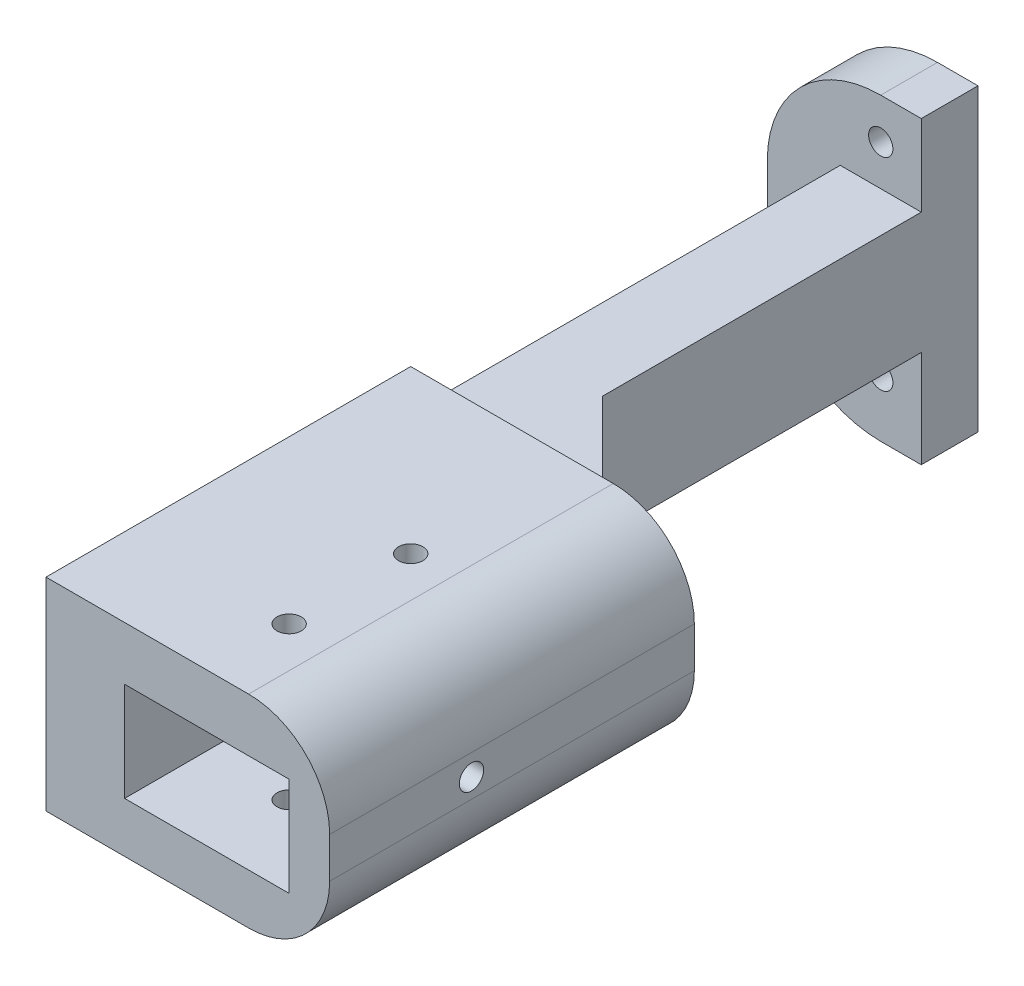
ISO-10303-21;
HEADER;
FILE_DESCRIPTION(('STEP AP214'),'2;1');
FILE_NAME('part.step','',(''),(''),'','','');
FILE_SCHEMA(('AUTOMOTIVE_DESIGN { 1 0 10303 214 1 1 1 1 }'));
ENDSEC;
DATA;
#1=APPLICATION_CONTEXT('core data for automotive mechanical design processes');
#2=APPLICATION_PROTOCOL_DEFINITION('international standard','automotive_design',2000,#1);
#3=PRODUCT_CONTEXT('',#1,'mechanical');
#4=PRODUCT('Part','Part','',(#3));
#5=PRODUCT_RELATED_PRODUCT_CATEGORY('part','',(#4));
#6=PRODUCT_DEFINITION_FORMATION('','',#4);
#7=PRODUCT_DEFINITION_CONTEXT('part definition',#1,'design');
#8=PRODUCT_DEFINITION('design','',#6,#7);
#9=PRODUCT_DEFINITION_SHAPE('','',#8);
#10=(LENGTH_UNIT() NAMED_UNIT(*) SI_UNIT(.MILLI.,.METRE.));
#11=(NAMED_UNIT(*) PLANE_ANGLE_UNIT() SI_UNIT($,.RADIAN.));
#12=(NAMED_UNIT(*) SI_UNIT($,.STERADIAN.) SOLID_ANGLE_UNIT());
#13=UNCERTAINTY_MEASURE_WITH_UNIT(LENGTH_MEASURE(1.E-05),#10,'distance_accuracy_value','');
#14=(GEOMETRIC_REPRESENTATION_CONTEXT(3) GLOBAL_UNCERTAINTY_ASSIGNED_CONTEXT((#13)) GLOBAL_UNIT_ASSIGNED_CONTEXT((#10,
#11,#12)) REPRESENTATION_CONTEXT('',''));
#15=CARTESIAN_POINT('',(0.,0.,0.));
#16=DIRECTION('',(0.,0.,1.));
#17=DIRECTION('',(1.,0.,0.));
#18=AXIS2_PLACEMENT_3D('',#15,#16,#17);
#19=CARTESIAN_POINT('',(-30.,7.,150.2));
#20=DIRECTION('',(0.,0.,1.));
#21=DIRECTION('',(1.,0.,0.));
#22=AXIS2_PLACEMENT_3D('',#19,#20,#21);
#23=CYLINDRICAL_SURFACE('',#22,10.);
#24=DIRECTION('',(0.,0.,1.));
#25=VECTOR('',#24,1.);
#26=CARTESIAN_POINT('',(-20.,7.,150.2));
#27=LINE('',#26,#25);
#28=CARTESIAN_POINT('',(-20.,7.,140.2));
#29=VERTEX_POINT('',#28);
#30=CARTESIAN_POINT('',(-20.,7.,185.2));
#31=VERTEX_POINT('',#30);
#32=EDGE_CURVE('E394',#29,#31,#27,.T.);
#33=ORIENTED_EDGE('',*,*,#32,.F.);
#34=CARTESIAN_POINT('',(-30.,7.,140.2));
#35=DIRECTION('',(0.,0.,1.));
#36=DIRECTION('',(1.,0.,0.));
#37=AXIS2_PLACEMENT_3D('',#34,#35,#36);
#38=CIRCLE('',#37,10.);
#39=CARTESIAN_POINT('',(-30.,17.,140.2));
#40=VERTEX_POINT('',#39);
#41=EDGE_CURVE('E40',#40,#29,#38,.F.);
#42=ORIENTED_EDGE('',*,*,#41,.F.);
#43=DIRECTION('',(0.,0.,1.));
#44=VECTOR('',#43,1.);
#45=CARTESIAN_POINT('',(-30.,17.,150.2));
#46=LINE('',#45,#44);
#47=CARTESIAN_POINT('',(-30.,17.,185.2));
#48=VERTEX_POINT('',#47);
#49=EDGE_CURVE('E396',#48,#40,#46,.F.);
#50=ORIENTED_EDGE('',*,*,#49,.F.);
#51=CARTESIAN_POINT('',(-30.,7.,185.2));
#52=DIRECTION('',(0.,0.,1.));
#53=DIRECTION('',(1.,0.,0.));
#54=AXIS2_PLACEMENT_3D('',#51,#52,#53);
#55=CIRCLE('',#54,10.);
#56=EDGE_CURVE('E11',#31,#48,#55,.T.);
#57=ORIENTED_EDGE('',*,*,#56,.F.);
#58=EDGE_LOOP('',(#33,#42,#50,#57));
#59=FACE_BOUND('',#58,.T.);
#60=ADVANCED_FACE('F33',(#59),#23,.T.);
#61=CARTESIAN_POINT('',(-30.,2.,150.2));
#62=DIRECTION('',(0.,0.,1.));
#63=DIRECTION('',(1.,0.,0.));
#64=AXIS2_PLACEMENT_3D('',#61,#62,#63);
#65=CYLINDRICAL_SURFACE('',#64,10.);
#66=DIRECTION('',(0.,0.,1.));
#67=VECTOR('',#66,1.);
#68=CARTESIAN_POINT('',(-30.,-8.,150.2));
#69=LINE('',#68,#67);
#70=CARTESIAN_POINT('',(-30.,-8.,140.2));
#71=VERTEX_POINT('',#70);
#72=CARTESIAN_POINT('',(-30.,-8.,185.2));
#73=VERTEX_POINT('',#72);
#74=EDGE_CURVE('E372',#71,#73,#69,.T.);
#75=ORIENTED_EDGE('',*,*,#74,.F.);
#76=CARTESIAN_POINT('',(-30.,2.,140.2));
#77=DIRECTION('',(0.,0.,1.));
#78=DIRECTION('',(1.,0.,0.));
#79=AXIS2_PLACEMENT_3D('',#76,#77,#78);
#80=CIRCLE('',#79,10.);
#81=CARTESIAN_POINT('',(-20.,2.,140.2));
#82=VERTEX_POINT('',#81);
#83=EDGE_CURVE('E379',#82,#71,#80,.F.);
#84=ORIENTED_EDGE('',*,*,#83,.F.);
#85=DIRECTION('',(0.,0.,1.));
#86=VECTOR('',#85,1.);
#87=CARTESIAN_POINT('',(-20.,2.,150.2));
#88=LINE('',#87,#86);
#89=CARTESIAN_POINT('',(-20.,2.,185.2));
#90=VERTEX_POINT('',#89);
#91=EDGE_CURVE('E383',#90,#82,#88,.F.);
#92=ORIENTED_EDGE('',*,*,#91,.F.);
#93=CARTESIAN_POINT('',(-30.,2.,185.2));
#94=DIRECTION('',(0.,0.,1.));
#95=DIRECTION('',(1.,0.,0.));
#96=AXIS2_PLACEMENT_3D('',#93,#94,#95);
#97=CIRCLE('',#96,10.);
#98=EDGE_CURVE('E382',#73,#90,#97,.T.);
#99=ORIENTED_EDGE('',*,*,#98,.F.);
#100=EDGE_LOOP('',(#75,#84,#92,#99));
#101=FACE_BOUND('',#100,.T.);
#102=ADVANCED_FACE('F385',(#101),#65,.T.);
#103=CARTESIAN_POINT('',(-50.,-1.,0.));
#104=DIRECTION('',(0.,0.,1.));
#105=DIRECTION('',(1.,0.,0.));
#106=AXIS2_PLACEMENT_3D('',#103,#104,#105);
#107=CYLINDRICAL_SURFACE('',#106,14.);
#108=DIRECTION('',(0.,0.,-1.));
#109=VECTOR('',#108,1.);
#110=CARTESIAN_POINT('',(-50.,-15.,0.));
#111=LINE('',#110,#109);
#112=CARTESIAN_POINT('',(-50.,-15.,87.2));
#113=VERTEX_POINT('',#112);
#114=CARTESIAN_POINT('',(-50.,-15.,80.2));
#115=VERTEX_POINT('',#114);
#116=EDGE_CURVE('E513',#113,#115,#111,.T.);
#117=ORIENTED_EDGE('',*,*,#116,.F.);
#118=CARTESIAN_POINT('',(-50.,-1.,87.2));
#119=DIRECTION('',(0.,0.,1.));
#120=DIRECTION('',(1.,0.,0.));
#121=AXIS2_PLACEMENT_3D('',#118,#119,#120);
#122=CIRCLE('',#121,14.);
#123=CARTESIAN_POINT('',(-64.,-1.00000000000001,87.2));
#124=VERTEX_POINT('',#123);
#125=EDGE_CURVE('E389',#124,#113,#122,.T.);
#126=ORIENTED_EDGE('',*,*,#125,.F.);
#127=DIRECTION('',(0.,0.,-1.));
#128=VECTOR('',#127,1.);
#129=CARTESIAN_POINT('',(-64.,-1.00000000000001,0.));
#130=LINE('',#129,#128);
#131=CARTESIAN_POINT('',(-64.,-1.00000000000001,80.2));
#132=VERTEX_POINT('',#131);
#133=EDGE_CURVE('E516',#132,#124,#130,.F.);
#134=ORIENTED_EDGE('',*,*,#133,.F.);
#135=CARTESIAN_POINT('',(-50.,-1.,80.2));
#136=DIRECTION('',(0.,0.,1.));
#137=DIRECTION('',(1.,0.,0.));
#138=AXIS2_PLACEMENT_3D('',#135,#136,#137);
#139=CIRCLE('',#138,14.);
#140=EDGE_CURVE('E386',#115,#132,#139,.F.);
#141=ORIENTED_EDGE('',*,*,#140,.F.);
#142=EDGE_LOOP('',(#117,#126,#134,#141));
#143=FACE_BOUND('',#142,.T.);
#144=ADVANCED_FACE('F489',(#143),#107,.T.);
#145=CARTESIAN_POINT('',(-50.,8.,0.));
#146=DIRECTION('',(0.,0.,1.));
#147=DIRECTION('',(1.,0.,0.));
#148=AXIS2_PLACEMENT_3D('',#145,#146,#147);
#149=CYLINDRICAL_SURFACE('',#148,14.);
#150=DIRECTION('',(0.,0.,1.));
#151=VECTOR('',#150,1.);
#152=CARTESIAN_POINT('',(-50.,22.,0.));
#153=LINE('',#152,#151);
#154=CARTESIAN_POINT('',(-50.,22.,80.2));
#155=VERTEX_POINT('',#154);
#156=CARTESIAN_POINT('',(-50.,22.,87.2));
#157=VERTEX_POINT('',#156);
#158=EDGE_CURVE('E443',#155,#157,#153,.T.);
#159=ORIENTED_EDGE('',*,*,#158,.F.);
#160=CARTESIAN_POINT('',(-50.,8.,80.2));
#161=DIRECTION('',(0.,0.,1.));
#162=DIRECTION('',(1.,0.,0.));
#163=AXIS2_PLACEMENT_3D('',#160,#161,#162);
#164=CIRCLE('',#163,14.);
#165=CARTESIAN_POINT('',(-64.,7.99999999999999,80.2));
#166=VERTEX_POINT('',#165);
#167=EDGE_CURVE('E210',#166,#155,#164,.F.);
#168=ORIENTED_EDGE('',*,*,#167,.F.);
#169=DIRECTION('',(0.,0.,1.));
#170=VECTOR('',#169,1.);
#171=CARTESIAN_POINT('',(-64.,7.99999999999999,87.2));
#172=LINE('',#171,#170);
#173=CARTESIAN_POINT('',(-64.,7.99999999999999,87.2));
#174=VERTEX_POINT('',#173);
#175=EDGE_CURVE('E506',#174,#166,#172,.F.);
#176=ORIENTED_EDGE('',*,*,#175,.F.);
#177=CARTESIAN_POINT('',(-50.,8.,87.2));
#178=DIRECTION('',(0.,0.,1.));
#179=DIRECTION('',(1.,0.,0.));
#180=AXIS2_PLACEMENT_3D('',#177,#178,#179);
#181=CIRCLE('',#180,14.);
#182=EDGE_CURVE('E505',#157,#174,#181,.T.);
#183=ORIENTED_EDGE('',*,*,#182,.F.);
#184=EDGE_LOOP('',(#159,#168,#176,#183));
#185=FACE_BOUND('',#184,.T.);
#186=ADVANCED_FACE('F493',(#185),#149,.T.);
#187=CARTESIAN_POINT('',(-45.,-3.,140.2));
#188=DIRECTION('',(-1.,0.,0.));
#189=DIRECTION('',(0.,0.,1.));
#190=AXIS2_PLACEMENT_3D('',#187,#188,#189);
#191=PLANE('',#190);
#192=DIRECTION('',(0.,0.,-1.));
#193=VECTOR('',#192,1.);
#194=CARTESIAN_POINT('',(-45.,-3.,140.2));
#195=LINE('',#194,#193);
#196=CARTESIAN_POINT('',(-45.,-3.,140.2));
#197=VERTEX_POINT('',#196);
#198=CARTESIAN_POINT('',(-45.,-3.,136.547003294764));
#199=VERTEX_POINT('',#198);
#200=EDGE_CURVE('E415',#197,#199,#195,.T.);
#201=ORIENTED_EDGE('',*,*,#200,.T.);
#202=DIRECTION('',(0.,1.,0.));
#203=VECTOR('',#202,1.);
#204=CARTESIAN_POINT('',(-45.,-22.3082531075803,136.547003294764));
#205=LINE('',#204,#203);
#206=CARTESIAN_POINT('',(-45.,12.,136.547003294764));
#207=VERTEX_POINT('',#206);
#208=EDGE_CURVE('E249',#199,#207,#205,.T.);
#209=ORIENTED_EDGE('',*,*,#208,.T.);
#210=DIRECTION('',(0.,0.,-1.));
#211=VECTOR('',#210,1.);
#212=CARTESIAN_POINT('',(-45.,12.,140.2));
#213=LINE('',#212,#211);
#214=CARTESIAN_POINT('',(-45.,12.,140.2));
#215=VERTEX_POINT('',#214);
#216=EDGE_CURVE('E436',#215,#207,#213,.T.);
#217=ORIENTED_EDGE('',*,*,#216,.F.);
#218=DIRECTION('',(0.,1.,0.));
#219=VECTOR('',#218,1.);
#220=CARTESIAN_POINT('',(-45.,-3.,140.2));
#221=LINE('',#220,#219);
#222=EDGE_CURVE('E203',#197,#215,#221,.T.);
#223=ORIENTED_EDGE('',*,*,#222,.F.);
#224=EDGE_LOOP('',(#201,#209,#217,#223));
#225=FACE_BOUND('',#224,.T.);
#226=ADVANCED_FACE('F460',(#225),#191,.F.);
#227=CARTESIAN_POINT('',(0.,0.,140.2));
#228=DIRECTION('',(0.,0.,1.));
#229=DIRECTION('',(1.,0.,0.));
#230=AXIS2_PLACEMENT_3D('',#227,#228,#229);
#231=PLANE('',#230);
#232=DIRECTION('',(-1.,0.,0.));
#233=VECTOR('',#232,1.);
#234=CARTESIAN_POINT('',(-55.,17.,140.2));
#235=LINE('',#234,#233);
#236=CARTESIAN_POINT('',(-55.,17.,140.2));
#237=VERTEX_POINT('',#236);
#238=EDGE_CURVE('E358',#40,#237,#235,.T.);
#239=ORIENTED_EDGE('',*,*,#238,.F.);
#240=ORIENTED_EDGE('',*,*,#41,.T.);
#241=DIRECTION('',(0.,1.,0.));
#242=VECTOR('',#241,1.);
#243=CARTESIAN_POINT('',(-20.,17.,140.2));
#244=LINE('',#243,#242);
#245=EDGE_CURVE('E359',#82,#29,#244,.T.);
#246=ORIENTED_EDGE('',*,*,#245,.F.);
#247=ORIENTED_EDGE('',*,*,#83,.T.);
#248=DIRECTION('',(1.,0.,0.));
#249=VECTOR('',#248,1.);
#250=CARTESIAN_POINT('',(-55.,-8.,140.2));
#251=LINE('',#250,#249);
#252=CARTESIAN_POINT('',(-55.,-8.,140.2));
#253=VERTEX_POINT('',#252);
#254=EDGE_CURVE('E344',#253,#71,#251,.T.);
#255=ORIENTED_EDGE('',*,*,#254,.F.);
#256=DIRECTION('',(0.,-1.,0.));
#257=VECTOR('',#256,1.);
#258=CARTESIAN_POINT('',(-55.,17.,140.2));
#259=LINE('',#258,#257);
#260=CARTESIAN_POINT('',(-55.,-3.,140.2));
#261=VERTEX_POINT('',#260);
#262=EDGE_CURVE('E341',#261,#253,#259,.T.);
#263=ORIENTED_EDGE('',*,*,#262,.F.);
#264=DIRECTION('',(1.,0.,0.));
#265=VECTOR('',#264,1.);
#266=CARTESIAN_POINT('',(-45.,-3.,140.2));
#267=LINE('',#266,#265);
#268=EDGE_CURVE('E418',#261,#197,#267,.T.);
#269=ORIENTED_EDGE('',*,*,#268,.T.);
#270=ORIENTED_EDGE('',*,*,#222,.T.);
#271=DIRECTION('',(-1.,0.,0.));
#272=VECTOR('',#271,1.);
#273=CARTESIAN_POINT('',(-45.,12.,140.2));
#274=LINE('',#273,#272);
#275=CARTESIAN_POINT('',(-55.,12.,140.2));
#276=VERTEX_POINT('',#275);
#277=EDGE_CURVE('E422',#215,#276,#274,.T.);
#278=ORIENTED_EDGE('',*,*,#277,.T.);
#279=EDGE_CURVE('E350',#237,#276,#259,.T.);
#280=ORIENTED_EDGE('',*,*,#279,.F.);
#281=EDGE_LOOP('',(#239,#240,#246,#247,#255,#263,#269,#270,#278,#280));
#282=FACE_BOUND('',#281,.T.);
#283=DIRECTION('',(1.,0.,0.));
#284=VECTOR('',#283,1.);
#285=CARTESIAN_POINT('',(-31.3470032947637,12.,140.2));
#286=LINE('',#285,#284);
#287=CARTESIAN_POINT('',(-41.3470032947637,12.,140.2));
#288=VERTEX_POINT('',#287);
#289=CARTESIAN_POINT('',(-31.3470032947637,12.,140.2));
#290=VERTEX_POINT('',#289);
#291=EDGE_CURVE('E255',#288,#290,#286,.T.);
#292=ORIENTED_EDGE('',*,*,#291,.F.);
#293=DIRECTION('',(0.,1.,0.));
#294=VECTOR('',#293,1.);
#295=CARTESIAN_POINT('',(-41.3470032947637,-22.3082531075803,140.2));
#296=LINE('',#295,#294);
#297=CARTESIAN_POINT('',(-41.3470032947637,-3.,140.2));
#298=VERTEX_POINT('',#297);
#299=EDGE_CURVE('E261',#298,#288,#296,.T.);
#300=ORIENTED_EDGE('',*,*,#299,.F.);
#301=DIRECTION('',(-1.,0.,0.));
#302=VECTOR('',#301,1.);
#303=CARTESIAN_POINT('',(-31.3470032947637,-3.,140.2));
#304=LINE('',#303,#302);
#305=CARTESIAN_POINT('',(-31.3470032947637,-3.,140.2));
#306=VERTEX_POINT('',#305);
#307=EDGE_CURVE('E252',#306,#298,#304,.T.);
#308=ORIENTED_EDGE('',*,*,#307,.F.);
#309=DIRECTION('',(0.,1.,0.));
#310=VECTOR('',#309,1.);
#311=CARTESIAN_POINT('',(-31.3470032947637,-22.3082531075803,140.2));
#312=LINE('',#311,#310);
#313=EDGE_CURVE('E266',#306,#290,#312,.T.);
#314=ORIENTED_EDGE('',*,*,#313,.T.);
#315=EDGE_LOOP('',(#292,#300,#308,#314));
#316=FACE_BOUND('',#315,.T.);
#317=ADVANCED_FACE('F376',(#282,#316),#231,.F.);
#318=CARTESIAN_POINT('',(-45.,-3.,126.547003294764));
#319=VERTEX_POINT('',#318);
#320=CARTESIAN_POINT('',(-45.,-3.,87.2));
#321=VERTEX_POINT('',#320);
#322=EDGE_CURVE('E421',#319,#321,#195,.T.);
#323=ORIENTED_EDGE('',*,*,#322,.T.);
#324=DIRECTION('',(0.,1.,0.));
#325=VECTOR('',#324,1.);
#326=CARTESIAN_POINT('',(-45.,-15.,87.2));
#327=LINE('',#326,#325);
#328=CARTESIAN_POINT('',(-45.,-15.,87.2));
#329=VERTEX_POINT('',#328);
#330=EDGE_CURVE('E233',#329,#321,#327,.T.);
#331=ORIENTED_EDGE('',*,*,#330,.F.);
#332=DIRECTION('',(0.,0.,-1.));
#333=VECTOR('',#332,1.);
#334=CARTESIAN_POINT('',(-45.,-15.,87.2));
#335=LINE('',#334,#333);
#336=CARTESIAN_POINT('',(-45.,-15.,80.2));
#337=VERTEX_POINT('',#336);
#338=EDGE_CURVE('E199',#329,#337,#335,.T.);
#339=ORIENTED_EDGE('',*,*,#338,.T.);
#340=DIRECTION('',(0.,1.,0.));
#341=VECTOR('',#340,1.);
#342=CARTESIAN_POINT('',(-45.,-3.,80.2));
#343=LINE('',#342,#341);
#344=CARTESIAN_POINT('',(-45.,22.,80.2));
#345=VERTEX_POINT('',#344);
#346=EDGE_CURVE('E190',#337,#345,#343,.T.);
#347=ORIENTED_EDGE('',*,*,#346,.T.);
#348=DIRECTION('',(0.,0.,-1.));
#349=VECTOR('',#348,1.);
#350=CARTESIAN_POINT('',(-45.,22.,87.2));
#351=LINE('',#350,#349);
#352=CARTESIAN_POINT('',(-45.,22.,87.2));
#353=VERTEX_POINT('',#352);
#354=EDGE_CURVE('E196',#353,#345,#351,.T.);
#355=ORIENTED_EDGE('',*,*,#354,.F.);
#356=CARTESIAN_POINT('',(-45.,12.,87.2));
#357=VERTEX_POINT('',#356);
#358=EDGE_CURVE('E237',#357,#353,#327,.T.);
#359=ORIENTED_EDGE('',*,*,#358,.F.);
#360=CARTESIAN_POINT('',(-45.,12.,126.547003294764));
#361=VERTEX_POINT('',#360);
#362=EDGE_CURVE('E439',#361,#357,#213,.T.);
#363=ORIENTED_EDGE('',*,*,#362,.F.);
#364=DIRECTION('',(0.,1.,0.));
#365=VECTOR('',#364,1.);
#366=CARTESIAN_POINT('',(-45.,-22.3082531075803,126.547003294764));
#367=LINE('',#366,#365);
#368=EDGE_CURVE('E263',#319,#361,#367,.T.);
#369=ORIENTED_EDGE('',*,*,#368,.F.);
#370=EDGE_LOOP('',(#323,#331,#339,#347,#355,#359,#363,#369));
#371=FACE_BOUND('',#370,.T.);
#372=ADVANCED_FACE('F193',(#371),#191,.F.);
#373=CARTESIAN_POINT('',(-45.,12.,140.2));
#374=DIRECTION('',(0.,-1.,0.));
#375=DIRECTION('',(1.,0.,0.));
#376=AXIS2_PLACEMENT_3D('',#373,#374,#375);
#377=PLANE('',#376);
#378=ORIENTED_EDGE('',*,*,#362,.T.);
#379=DIRECTION('',(-1.,0.,0.));
#380=VECTOR('',#379,1.);
#381=CARTESIAN_POINT('',(-45.,12.,87.2));
#382=LINE('',#381,#380);
#383=CARTESIAN_POINT('',(-55.,12.,87.2));
#384=VERTEX_POINT('',#383);
#385=EDGE_CURVE('E242',#357,#384,#382,.T.);
#386=ORIENTED_EDGE('',*,*,#385,.T.);
#387=DIRECTION('',(0.,0.,-1.));
#388=VECTOR('',#387,1.);
#389=CARTESIAN_POINT('',(-55.,12.,140.2));
#390=LINE('',#389,#388);
#391=EDGE_CURVE('E414',#276,#384,#390,.T.);
#392=ORIENTED_EDGE('',*,*,#391,.F.);
#393=ORIENTED_EDGE('',*,*,#277,.F.);
#394=ORIENTED_EDGE('',*,*,#216,.T.);
#395=DIRECTION('',(0.70710678118655,0.,0.707106781186545));
#396=VECTOR('',#395,1.);
#397=CARTESIAN_POINT('',(-41.3470032947637,12.,140.2));
#398=LINE('',#397,#396);
#399=EDGE_CURVE('E244',#207,#288,#398,.T.);
#400=ORIENTED_EDGE('',*,*,#399,.T.);
#401=ORIENTED_EDGE('',*,*,#291,.T.);
#402=DIRECTION('',(-0.707106781186548,0.,-0.707106781186547));
#403=VECTOR('',#402,1.);
#404=CARTESIAN_POINT('',(-45.,12.,126.547003294764));
#405=LINE('',#404,#403);
#406=EDGE_CURVE('E258',#290,#361,#405,.T.);
#407=ORIENTED_EDGE('',*,*,#406,.T.);
#408=EDGE_LOOP('',(#378,#386,#392,#393,#394,#400,#401,#407));
#409=FACE_BOUND('',#408,.T.);
#410=ADVANCED_FACE('F461',(#409),#377,.F.);
#411=CARTESIAN_POINT('',(-55.,-3.,140.2));
#412=DIRECTION('',(1.,0.,0.));
#413=DIRECTION('',(0.,0.,-1.));
#414=AXIS2_PLACEMENT_3D('',#411,#412,#413);
#415=PLANE('',#414);
#416=CARTESIAN_POINT('',(-55.,4.4,167.7));
#417=DIRECTION('',(1.,0.,0.));
#418=DIRECTION('',(0.,0.,-1.));
#419=AXIS2_PLACEMENT_3D('',#416,#417,#418);
#420=CIRCLE('',#419,1.5);
#421=CARTESIAN_POINT('',(-55.,4.4,166.2));
#422=VERTEX_POINT('',#421);
#423=EDGE_CURVE('E279',#422,#422,#420,.T.);
#424=ORIENTED_EDGE('',*,*,#423,.T.);
#425=EDGE_LOOP('',(#424));
#426=FACE_BOUND('',#425,.T.);
#427=ORIENTED_EDGE('',*,*,#391,.T.);
#428=DIRECTION('',(0.,-1.,0.));
#429=VECTOR('',#428,1.);
#430=CARTESIAN_POINT('',(-55.,-3.,87.2));
#431=LINE('',#430,#429);
#432=CARTESIAN_POINT('',(-55.,-3.,87.2));
#433=VERTEX_POINT('',#432);
#434=EDGE_CURVE('E236',#384,#433,#431,.T.);
#435=ORIENTED_EDGE('',*,*,#434,.T.);
#436=DIRECTION('',(0.,0.,-1.));
#437=VECTOR('',#436,1.);
#438=CARTESIAN_POINT('',(-55.,-3.,140.2));
#439=LINE('',#438,#437);
#440=EDGE_CURVE('E409',#261,#433,#439,.T.);
#441=ORIENTED_EDGE('',*,*,#440,.F.);
#442=ORIENTED_EDGE('',*,*,#262,.T.);
#443=DIRECTION('',(0.,0.,-1.));
#444=VECTOR('',#443,1.);
#445=CARTESIAN_POINT('',(-55.,-8.,150.2));
#446=LINE('',#445,#444);
#447=CARTESIAN_POINT('',(-55.,-8.,185.2));
#448=VERTEX_POINT('',#447);
#449=EDGE_CURVE('E204',#448,#253,#446,.T.);
#450=ORIENTED_EDGE('',*,*,#449,.F.);
#451=DIRECTION('',(0.,-1.,0.));
#452=VECTOR('',#451,1.);
#453=CARTESIAN_POINT('',(-55.,-8.,185.2));
#454=LINE('',#453,#452);
#455=CARTESIAN_POINT('',(-55.,17.,185.2));
#456=VERTEX_POINT('',#455);
#457=EDGE_CURVE('E335',#456,#448,#454,.T.);
#458=ORIENTED_EDGE('',*,*,#457,.F.);
#459=DIRECTION('',(0.,0.,-1.));
#460=VECTOR('',#459,1.);
#461=CARTESIAN_POINT('',(-55.,17.,150.2));
#462=LINE('',#461,#460);
#463=EDGE_CURVE('E355',#456,#237,#462,.T.);
#464=ORIENTED_EDGE('',*,*,#463,.T.);
#465=ORIENTED_EDGE('',*,*,#279,.T.);
#466=EDGE_LOOP('',(#427,#435,#441,#442,#450,#458,#464,#465));
#467=FACE_BOUND('',#466,.T.);
#468=ADVANCED_FACE('F407',(#426,#467),#415,.F.);
#469=CARTESIAN_POINT('',(-45.,-3.,140.2));
#470=DIRECTION('',(0.,1.,0.));
#471=DIRECTION('',(-1.,0.,0.));
#472=AXIS2_PLACEMENT_3D('',#469,#470,#471);
#473=PLANE('',#472);
#474=ORIENTED_EDGE('',*,*,#440,.T.);
#475=DIRECTION('',(1.,0.,0.));
#476=VECTOR('',#475,1.);
#477=CARTESIAN_POINT('',(-45.,-3.,87.2));
#478=LINE('',#477,#476);
#479=EDGE_CURVE('E438',#433,#321,#478,.T.);
#480=ORIENTED_EDGE('',*,*,#479,.T.);
#481=ORIENTED_EDGE('',*,*,#322,.F.);
#482=DIRECTION('',(0.707106781186548,0.,0.707106781186547));
#483=VECTOR('',#482,1.);
#484=CARTESIAN_POINT('',(-45.,-3.,126.547003294764));
#485=LINE('',#484,#483);
#486=EDGE_CURVE('E245',#319,#306,#485,.T.);
#487=ORIENTED_EDGE('',*,*,#486,.T.);
#488=ORIENTED_EDGE('',*,*,#307,.T.);
#489=DIRECTION('',(-0.70710678118655,0.,-0.707106781186545));
#490=VECTOR('',#489,1.);
#491=CARTESIAN_POINT('',(-41.3470032947637,-3.,140.2));
#492=LINE('',#491,#490);
#493=EDGE_CURVE('E248',#298,#199,#492,.T.);
#494=ORIENTED_EDGE('',*,*,#493,.T.);
#495=ORIENTED_EDGE('',*,*,#200,.F.);
#496=ORIENTED_EDGE('',*,*,#268,.F.);
#497=EDGE_LOOP('',(#474,#480,#481,#487,#488,#494,#495,#496));
#498=FACE_BOUND('',#497,.T.);
#499=ADVANCED_FACE('F419',(#498),#473,.F.);
#500=CARTESIAN_POINT('',(-55.,-8.,150.2));
#501=DIRECTION('',(0.,1.,0.));
#502=DIRECTION('',(0.,0.,1.));
#503=AXIS2_PLACEMENT_3D('',#500,#501,#502);
#504=PLANE('',#503);
#505=CARTESIAN_POINT('',(-35.,-8.,175.2));
#506=DIRECTION('',(0.,1.,0.));
#507=DIRECTION('',(0.,0.,1.));
#508=AXIS2_PLACEMENT_3D('',#505,#506,#507);
#509=CIRCLE('',#508,1.5);
#510=CARTESIAN_POINT('',(-35.,-8.,176.7));
#511=VERTEX_POINT('',#510);
#512=EDGE_CURVE('E289',#511,#511,#509,.T.);
#513=ORIENTED_EDGE('',*,*,#512,.T.);
#514=EDGE_LOOP('',(#513));
#515=FACE_BOUND('',#514,.T.);
#516=CARTESIAN_POINT('',(-35.,-8.,160.2));
#517=DIRECTION('',(0.,1.,0.));
#518=DIRECTION('',(0.,0.,1.));
#519=AXIS2_PLACEMENT_3D('',#516,#517,#518);
#520=CIRCLE('',#519,1.5);
#521=CARTESIAN_POINT('',(-35.,-8.,161.7));
#522=VERTEX_POINT('',#521);
#523=EDGE_CURVE('E299',#522,#522,#520,.T.);
#524=ORIENTED_EDGE('',*,*,#523,.T.);
#525=EDGE_LOOP('',(#524));
#526=FACE_BOUND('',#525,.T.);
#527=ORIENTED_EDGE('',*,*,#254,.T.);
#528=ORIENTED_EDGE('',*,*,#74,.T.);
#529=DIRECTION('',(1.,0.,0.));
#530=VECTOR('',#529,1.);
#531=CARTESIAN_POINT('',(-20.,-8.,185.2));
#532=LINE('',#531,#530);
#533=EDGE_CURVE('E338',#448,#73,#532,.T.);
#534=ORIENTED_EDGE('',*,*,#533,.F.);
#535=ORIENTED_EDGE('',*,*,#449,.T.);
#536=EDGE_LOOP('',(#527,#528,#534,#535));
#537=FACE_BOUND('',#536,.T.);
#538=ADVANCED_FACE('F369',(#515,#526,#537),#504,.F.);
#539=CARTESIAN_POINT('',(-20.,17.,150.2));
#540=DIRECTION('',(-1.,0.,0.));
#541=DIRECTION('',(0.,0.,1.));
#542=AXIS2_PLACEMENT_3D('',#539,#540,#541);
#543=PLANE('',#542);
#544=CARTESIAN_POINT('',(-20.,4.4,167.7));
#545=DIRECTION('',(1.,0.,0.));
#546=DIRECTION('',(0.,0.,-1.));
#547=AXIS2_PLACEMENT_3D('',#544,#545,#546);
#548=CIRCLE('',#547,1.5);
#549=CARTESIAN_POINT('',(-20.,4.4,166.2));
#550=VERTEX_POINT('',#549);
#551=EDGE_CURVE('E272',#550,#550,#548,.T.);
#552=ORIENTED_EDGE('',*,*,#551,.F.);
#553=EDGE_LOOP('',(#552));
#554=FACE_BOUND('',#553,.T.);
#555=ORIENTED_EDGE('',*,*,#245,.T.);
#556=ORIENTED_EDGE('',*,*,#32,.T.);
#557=DIRECTION('',(0.,1.,0.));
#558=VECTOR('',#557,1.);
#559=CARTESIAN_POINT('',(-20.,-8.,185.2));
#560=LINE('',#559,#558);
#561=EDGE_CURVE('E331',#90,#31,#560,.T.);
#562=ORIENTED_EDGE('',*,*,#561,.F.);
#563=ORIENTED_EDGE('',*,*,#91,.T.);
#564=EDGE_LOOP('',(#555,#556,#562,#563));
#565=FACE_BOUND('',#564,.T.);
#566=ADVANCED_FACE('F399',(#554,#565),#543,.F.);
#567=CARTESIAN_POINT('',(-55.,17.,150.2));
#568=DIRECTION('',(0.,-1.,0.));
#569=DIRECTION('',(0.,0.,-1.));
#570=AXIS2_PLACEMENT_3D('',#567,#568,#569);
#571=PLANE('',#570);
#572=CARTESIAN_POINT('',(-35.,17.,175.2));
#573=DIRECTION('',(0.,1.,0.));
#574=DIRECTION('',(0.,0.,1.));
#575=AXIS2_PLACEMENT_3D('',#572,#573,#574);
#576=CIRCLE('',#575,1.5);
#577=CARTESIAN_POINT('',(-35.,17.,176.7));
#578=VERTEX_POINT('',#577);
#579=EDGE_CURVE('E282',#578,#578,#576,.T.);
#580=ORIENTED_EDGE('',*,*,#579,.F.);
#581=EDGE_LOOP('',(#580));
#582=FACE_BOUND('',#581,.T.);
#583=CARTESIAN_POINT('',(-35.,17.,160.2));
#584=DIRECTION('',(0.,1.,0.));
#585=DIRECTION('',(0.,0.,1.));
#586=AXIS2_PLACEMENT_3D('',#583,#584,#585);
#587=CIRCLE('',#586,1.5);
#588=CARTESIAN_POINT('',(-35.,17.,161.7));
#589=VERTEX_POINT('',#588);
#590=EDGE_CURVE('E292',#589,#589,#587,.T.);
#591=ORIENTED_EDGE('',*,*,#590,.F.);
#592=EDGE_LOOP('',(#591));
#593=FACE_BOUND('',#592,.T.);
#594=DIRECTION('',(-1.,0.,0.));
#595=VECTOR('',#594,1.);
#596=CARTESIAN_POINT('',(-20.,17.,185.2));
#597=LINE('',#596,#595);
#598=EDGE_CURVE('E333',#48,#456,#597,.T.);
#599=ORIENTED_EDGE('',*,*,#598,.F.);
#600=ORIENTED_EDGE('',*,*,#49,.T.);
#601=ORIENTED_EDGE('',*,*,#238,.T.);
#602=ORIENTED_EDGE('',*,*,#463,.F.);
#603=EDGE_LOOP('',(#599,#600,#601,#602));
#604=FACE_BOUND('',#603,.T.);
#605=ADVANCED_FACE('F574',(#582,#593,#604),#571,.F.);
#606=CARTESIAN_POINT('',(0.,0.,185.2));
#607=DIRECTION('',(0.,0.,1.));
#608=DIRECTION('',(1.,0.,0.));
#609=AXIS2_PLACEMENT_3D('',#606,#607,#608);
#610=PLANE('',#609);
#611=ORIENTED_EDGE('',*,*,#561,.T.);
#612=ORIENTED_EDGE('',*,*,#56,.T.);
#613=ORIENTED_EDGE('',*,*,#598,.T.);
#614=ORIENTED_EDGE('',*,*,#457,.T.);
#615=ORIENTED_EDGE('',*,*,#533,.T.);
#616=ORIENTED_EDGE('',*,*,#98,.T.);
#617=EDGE_LOOP('',(#611,#612,#613,#614,#615,#616));
#618=FACE_BOUND('',#617,.T.);
#619=DIRECTION('',(-1.,0.,0.));
#620=VECTOR('',#619,1.);
#621=CARTESIAN_POINT('',(-25.,10.4,185.2));
#622=LINE('',#621,#620);
#623=CARTESIAN_POINT('',(-25.,10.4,185.2));
#624=VERTEX_POINT('',#623);
#625=CARTESIAN_POINT('',(-45.3,10.4,185.2));
#626=VERTEX_POINT('',#625);
#627=EDGE_CURVE('E305',#624,#626,#622,.T.);
#628=ORIENTED_EDGE('',*,*,#627,.F.);
#629=DIRECTION('',(0.,1.,0.));
#630=VECTOR('',#629,1.);
#631=CARTESIAN_POINT('',(-25.,-1.8,185.2));
#632=LINE('',#631,#630);
#633=CARTESIAN_POINT('',(-25.,-1.8,185.2));
#634=VERTEX_POINT('',#633);
#635=EDGE_CURVE('E303',#634,#624,#632,.T.);
#636=ORIENTED_EDGE('',*,*,#635,.F.);
#637=DIRECTION('',(1.,0.,0.));
#638=VECTOR('',#637,1.);
#639=CARTESIAN_POINT('',(-25.,-1.8,185.2));
#640=LINE('',#639,#638);
#641=CARTESIAN_POINT('',(-45.3,-1.8,185.2));
#642=VERTEX_POINT('',#641);
#643=EDGE_CURVE('E311',#642,#634,#640,.T.);
#644=ORIENTED_EDGE('',*,*,#643,.F.);
#645=DIRECTION('',(0.,-1.,0.));
#646=VECTOR('',#645,1.);
#647=CARTESIAN_POINT('',(-45.3,-1.8,185.2));
#648=LINE('',#647,#646);
#649=EDGE_CURVE('E308',#626,#642,#648,.T.);
#650=ORIENTED_EDGE('',*,*,#649,.F.);
#651=EDGE_LOOP('',(#628,#636,#644,#650));
#652=FACE_BOUND('',#651,.T.);
#653=ADVANCED_FACE('F400',(#618,#652),#610,.T.);
#654=CARTESIAN_POINT('',(-25.,-1.8,185.2));
#655=DIRECTION('',(-1.,0.,0.));
#656=DIRECTION('',(0.,0.,1.));
#657=AXIS2_PLACEMENT_3D('',#654,#655,#656);
#658=PLANE('',#657);
#659=CARTESIAN_POINT('',(-25.,4.4,167.7));
#660=DIRECTION('',(-1.,0.,0.));
#661=DIRECTION('',(0.,0.,1.));
#662=AXIS2_PLACEMENT_3D('',#659,#660,#661);
#663=CIRCLE('',#662,1.5);
#664=CARTESIAN_POINT('',(-25.,4.4,169.2));
#665=VERTEX_POINT('',#664);
#666=EDGE_CURVE('E276',#665,#665,#663,.T.);
#667=ORIENTED_EDGE('',*,*,#666,.F.);
#668=EDGE_LOOP('',(#667));
#669=FACE_BOUND('',#668,.T.);
#670=DIRECTION('',(0.,1.,0.));
#671=VECTOR('',#670,1.);
#672=CARTESIAN_POINT('',(-25.,-1.8,150.2));
#673=LINE('',#672,#671);
#674=CARTESIAN_POINT('',(-25.,-1.8,150.2));
#675=VERTEX_POINT('',#674);
#676=CARTESIAN_POINT('',(-25.,10.4,150.2));
#677=VERTEX_POINT('',#676);
#678=EDGE_CURVE('E302',#675,#677,#673,.T.);
#679=ORIENTED_EDGE('',*,*,#678,.F.);
#680=DIRECTION('',(0.,0.,-1.));
#681=VECTOR('',#680,1.);
#682=CARTESIAN_POINT('',(-25.,-1.8,185.2));
#683=LINE('',#682,#681);
#684=EDGE_CURVE('E313',#634,#675,#683,.T.);
#685=ORIENTED_EDGE('',*,*,#684,.F.);
#686=ORIENTED_EDGE('',*,*,#635,.T.);
#687=DIRECTION('',(0.,0.,-1.));
#688=VECTOR('',#687,1.);
#689=CARTESIAN_POINT('',(-25.,10.4,185.2));
#690=LINE('',#689,#688);
#691=EDGE_CURVE('E328',#624,#677,#690,.T.);
#692=ORIENTED_EDGE('',*,*,#691,.T.);
#693=EDGE_LOOP('',(#679,#685,#686,#692));
#694=FACE_BOUND('',#693,.T.);
#695=ADVANCED_FACE('F567',(#669,#694),#658,.T.);
#696=CARTESIAN_POINT('',(-25.,10.4,185.2));
#697=DIRECTION('',(0.,-1.,0.));
#698=DIRECTION('',(1.,0.,0.));
#699=AXIS2_PLACEMENT_3D('',#696,#697,#698);
#700=PLANE('',#699);
#701=CARTESIAN_POINT('',(-35.,10.4,175.2));
#702=DIRECTION('',(0.,-1.,0.));
#703=DIRECTION('',(1.,0.,0.));
#704=AXIS2_PLACEMENT_3D('',#701,#702,#703);
#705=CIRCLE('',#704,1.5);
#706=CARTESIAN_POINT('',(-33.5,10.4,175.2));
#707=VERTEX_POINT('',#706);
#708=EDGE_CURVE('E286',#707,#707,#705,.T.);
#709=ORIENTED_EDGE('',*,*,#708,.F.);
#710=EDGE_LOOP('',(#709));
#711=FACE_BOUND('',#710,.T.);
#712=CARTESIAN_POINT('',(-35.,10.4,160.2));
#713=DIRECTION('',(0.,-1.,0.));
#714=DIRECTION('',(1.,0.,0.));
#715=AXIS2_PLACEMENT_3D('',#712,#713,#714);
#716=CIRCLE('',#715,1.5);
#717=CARTESIAN_POINT('',(-33.5,10.4,160.2));
#718=VERTEX_POINT('',#717);
#719=EDGE_CURVE('E296',#718,#718,#716,.T.);
#720=ORIENTED_EDGE('',*,*,#719,.F.);
#721=EDGE_LOOP('',(#720));
#722=FACE_BOUND('',#721,.T.);
#723=DIRECTION('',(-1.,0.,0.));
#724=VECTOR('',#723,1.);
#725=CARTESIAN_POINT('',(-25.,10.4,150.2));
#726=LINE('',#725,#724);
#727=CARTESIAN_POINT('',(-45.3,10.4,150.2));
#728=VERTEX_POINT('',#727);
#729=EDGE_CURVE('E315',#677,#728,#726,.T.);
#730=ORIENTED_EDGE('',*,*,#729,.F.);
#731=ORIENTED_EDGE('',*,*,#691,.F.);
#732=ORIENTED_EDGE('',*,*,#627,.T.);
#733=DIRECTION('',(0.,0.,-1.));
#734=VECTOR('',#733,1.);
#735=CARTESIAN_POINT('',(-45.3,10.4,185.2));
#736=LINE('',#735,#734);
#737=EDGE_CURVE('E325',#626,#728,#736,.T.);
#738=ORIENTED_EDGE('',*,*,#737,.T.);
#739=EDGE_LOOP('',(#730,#731,#732,#738));
#740=FACE_BOUND('',#739,.T.);
#741=ADVANCED_FACE('F563',(#711,#722,#740),#700,.T.);
#742=CARTESIAN_POINT('',(-45.3,-1.8,185.2));
#743=DIRECTION('',(1.,0.,0.));
#744=DIRECTION('',(0.,0.,-1.));
#745=AXIS2_PLACEMENT_3D('',#742,#743,#744);
#746=PLANE('',#745);
#747=CARTESIAN_POINT('',(-45.3,4.4,167.7));
#748=DIRECTION('',(1.,0.,0.));
#749=DIRECTION('',(0.,0.,-1.));
#750=AXIS2_PLACEMENT_3D('',#747,#748,#749);
#751=CIRCLE('',#750,1.5);
#752=CARTESIAN_POINT('',(-45.3,4.4,166.2));
#753=VERTEX_POINT('',#752);
#754=EDGE_CURVE('E275',#753,#753,#751,.T.);
#755=ORIENTED_EDGE('',*,*,#754,.F.);
#756=EDGE_LOOP('',(#755));
#757=FACE_BOUND('',#756,.T.);
#758=DIRECTION('',(0.,-1.,0.));
#759=VECTOR('',#758,1.);
#760=CARTESIAN_POINT('',(-45.3,-1.8,150.2));
#761=LINE('',#760,#759);
#762=CARTESIAN_POINT('',(-45.3,-1.8,150.2));
#763=VERTEX_POINT('',#762);
#764=EDGE_CURVE('E317',#728,#763,#761,.T.);
#765=ORIENTED_EDGE('',*,*,#764,.F.);
#766=ORIENTED_EDGE('',*,*,#737,.F.);
#767=ORIENTED_EDGE('',*,*,#649,.T.);
#768=DIRECTION('',(0.,0.,-1.));
#769=VECTOR('',#768,1.);
#770=CARTESIAN_POINT('',(-45.3,-1.8,185.2));
#771=LINE('',#770,#769);
#772=EDGE_CURVE('E322',#642,#763,#771,.T.);
#773=ORIENTED_EDGE('',*,*,#772,.T.);
#774=EDGE_LOOP('',(#765,#766,#767,#773));
#775=FACE_BOUND('',#774,.T.);
#776=ADVANCED_FACE('F559',(#757,#775),#746,.T.);
#777=CARTESIAN_POINT('',(-25.,-1.8,185.2));
#778=DIRECTION('',(0.,1.,0.));
#779=DIRECTION('',(-1.,0.,0.));
#780=AXIS2_PLACEMENT_3D('',#777,#778,#779);
#781=PLANE('',#780);
#782=CARTESIAN_POINT('',(-35.,-1.8,175.2));
#783=DIRECTION('',(0.,1.,0.));
#784=DIRECTION('',(-1.,0.,0.));
#785=AXIS2_PLACEMENT_3D('',#782,#783,#784);
#786=CIRCLE('',#785,1.5);
#787=CARTESIAN_POINT('',(-36.5,-1.8,175.2));
#788=VERTEX_POINT('',#787);
#789=EDGE_CURVE('E285',#788,#788,#786,.T.);
#790=ORIENTED_EDGE('',*,*,#789,.F.);
#791=EDGE_LOOP('',(#790));
#792=FACE_BOUND('',#791,.T.);
#793=CARTESIAN_POINT('',(-35.,-1.8,160.2));
#794=DIRECTION('',(0.,1.,0.));
#795=DIRECTION('',(-1.,0.,0.));
#796=AXIS2_PLACEMENT_3D('',#793,#794,#795);
#797=CIRCLE('',#796,1.5);
#798=CARTESIAN_POINT('',(-36.5,-1.8,160.2));
#799=VERTEX_POINT('',#798);
#800=EDGE_CURVE('E295',#799,#799,#797,.T.);
#801=ORIENTED_EDGE('',*,*,#800,.F.);
#802=EDGE_LOOP('',(#801));
#803=FACE_BOUND('',#802,.T.);
#804=DIRECTION('',(1.,0.,0.));
#805=VECTOR('',#804,1.);
#806=CARTESIAN_POINT('',(-25.,-1.8,150.2));
#807=LINE('',#806,#805);
#808=EDGE_CURVE('E306',#763,#675,#807,.T.);
#809=ORIENTED_EDGE('',*,*,#808,.F.);
#810=ORIENTED_EDGE('',*,*,#772,.F.);
#811=ORIENTED_EDGE('',*,*,#643,.T.);
#812=ORIENTED_EDGE('',*,*,#684,.T.);
#813=EDGE_LOOP('',(#809,#810,#811,#812));
#814=FACE_BOUND('',#813,.T.);
#815=ADVANCED_FACE('F556',(#792,#803,#814),#781,.T.);
#816=CARTESIAN_POINT('',(0.,0.,150.2));
#817=DIRECTION('',(0.,0.,1.));
#818=DIRECTION('',(1.,0.,0.));
#819=AXIS2_PLACEMENT_3D('',#816,#817,#818);
#820=PLANE('',#819);
#821=ORIENTED_EDGE('',*,*,#678,.T.);
#822=ORIENTED_EDGE('',*,*,#729,.T.);
#823=ORIENTED_EDGE('',*,*,#764,.T.);
#824=ORIENTED_EDGE('',*,*,#808,.T.);
#825=EDGE_LOOP('',(#821,#822,#823,#824));
#826=FACE_BOUND('',#825,.T.);
#827=ADVANCED_FACE('F554',(#826),#820,.T.);
#828=CARTESIAN_POINT('',(-35.,-13.,160.2));
#829=DIRECTION('',(0.,1.,0.));
#830=DIRECTION('',(0.,0.,1.));
#831=AXIS2_PLACEMENT_3D('',#828,#829,#830);
#832=CYLINDRICAL_SURFACE('',#831,1.5);
#833=ORIENTED_EDGE('',*,*,#800,.T.);
#834=EDGE_LOOP('',(#833));
#835=FACE_BOUND('',#834,.T.);
#836=ORIENTED_EDGE('',*,*,#523,.F.);
#837=EDGE_LOOP('',(#836));
#838=FACE_BOUND('',#837,.T.);
#839=ADVANCED_FACE('F551',(#835,#838),#832,.F.);
#840=ORIENTED_EDGE('',*,*,#719,.T.);
#841=EDGE_LOOP('',(#840));
#842=FACE_BOUND('',#841,.T.);
#843=ORIENTED_EDGE('',*,*,#590,.T.);
#844=EDGE_LOOP('',(#843));
#845=FACE_BOUND('',#844,.T.);
#846=ADVANCED_FACE('F549',(#842,#845),#832,.F.);
#847=CARTESIAN_POINT('',(-35.,-13.,175.2));
#848=DIRECTION('',(0.,1.,0.));
#849=DIRECTION('',(0.,0.,1.));
#850=AXIS2_PLACEMENT_3D('',#847,#848,#849);
#851=CYLINDRICAL_SURFACE('',#850,1.5);
#852=ORIENTED_EDGE('',*,*,#789,.T.);
#853=EDGE_LOOP('',(#852));
#854=FACE_BOUND('',#853,.T.);
#855=ORIENTED_EDGE('',*,*,#512,.F.);
#856=EDGE_LOOP('',(#855));
#857=FACE_BOUND('',#856,.T.);
#858=ADVANCED_FACE('F546',(#854,#857),#851,.F.);
#859=ORIENTED_EDGE('',*,*,#708,.T.);
#860=EDGE_LOOP('',(#859));
#861=FACE_BOUND('',#860,.T.);
#862=ORIENTED_EDGE('',*,*,#579,.T.);
#863=EDGE_LOOP('',(#862));
#864=FACE_BOUND('',#863,.T.);
#865=ADVANCED_FACE('F544',(#861,#864),#851,.F.);
#866=CARTESIAN_POINT('',(-69.,4.4,167.7));
#867=DIRECTION('',(1.,0.,0.));
#868=DIRECTION('',(0.,0.,-1.));
#869=AXIS2_PLACEMENT_3D('',#866,#867,#868);
#870=CYLINDRICAL_SURFACE('',#869,1.5);
#871=ORIENTED_EDGE('',*,*,#754,.T.);
#872=EDGE_LOOP('',(#871));
#873=FACE_BOUND('',#872,.T.);
#874=ORIENTED_EDGE('',*,*,#423,.F.);
#875=EDGE_LOOP('',(#874));
#876=FACE_BOUND('',#875,.T.);
#877=ADVANCED_FACE('F541',(#873,#876),#870,.F.);
#878=ORIENTED_EDGE('',*,*,#666,.T.);
#879=EDGE_LOOP('',(#878));
#880=FACE_BOUND('',#879,.T.);
#881=ORIENTED_EDGE('',*,*,#551,.T.);
#882=EDGE_LOOP('',(#881));
#883=FACE_BOUND('',#882,.T.);
#884=ADVANCED_FACE('F540',(#880,#883),#870,.F.);
#885=CARTESIAN_POINT('',(-41.3470032947637,-22.3082531075803,140.2));
#886=DIRECTION('',(-0.707106781186545,0.,0.70710678118655));
#887=DIRECTION('',(0.70710678118655,0.,0.707106781186545));
#888=AXIS2_PLACEMENT_3D('',#885,#886,#887);
#889=PLANE('',#888);
#890=ORIENTED_EDGE('',*,*,#493,.F.);
#891=ORIENTED_EDGE('',*,*,#299,.T.);
#892=ORIENTED_EDGE('',*,*,#399,.F.);
#893=ORIENTED_EDGE('',*,*,#208,.F.);
#894=EDGE_LOOP('',(#890,#891,#892,#893));
#895=FACE_BOUND('',#894,.T.);
#896=ADVANCED_FACE('F458',(#895),#889,.T.);
#897=CARTESIAN_POINT('',(-45.,-22.3082531075803,126.547003294764));
#898=DIRECTION('',(0.707106781186547,0.,-0.707106781186548));
#899=DIRECTION('',(-0.707106781186548,0.,-0.707106781186547));
#900=AXIS2_PLACEMENT_3D('',#897,#898,#899);
#901=PLANE('',#900);
#902=ORIENTED_EDGE('',*,*,#486,.F.);
#903=ORIENTED_EDGE('',*,*,#368,.T.);
#904=ORIENTED_EDGE('',*,*,#406,.F.);
#905=ORIENTED_EDGE('',*,*,#313,.F.);
#906=EDGE_LOOP('',(#902,#903,#904,#905));
#907=FACE_BOUND('',#906,.T.);
#908=ADVANCED_FACE('F454',(#907),#901,.T.);
#909=CARTESIAN_POINT('',(-45.,-15.,87.2));
#910=DIRECTION('',(0.,0.,1.));
#911=DIRECTION('',(1.,0.,0.));
#912=AXIS2_PLACEMENT_3D('',#909,#910,#911);
#913=PLANE('',#912);
#914=CARTESIAN_POINT('',(-60.0000000000001,4.5,87.2));
#915=DIRECTION('',(0.,0.,1.));
#916=DIRECTION('',(1.,0.,0.));
#917=AXIS2_PLACEMENT_3D('',#914,#915,#916);
#918=CIRCLE('',#917,1.5);
#919=CARTESIAN_POINT('',(-58.5000000000001,4.5,87.2));
#920=VERTEX_POINT('',#919);
#921=EDGE_CURVE('E724',#920,#920,#918,.T.);
#922=ORIENTED_EDGE('',*,*,#921,.F.);
#923=EDGE_LOOP('',(#922));
#924=FACE_BOUND('',#923,.T.);
#925=CARTESIAN_POINT('',(-50.0000000000001,-8.,87.2));
#926=DIRECTION('',(0.,0.,1.));
#927=DIRECTION('',(1.,0.,0.));
#928=AXIS2_PLACEMENT_3D('',#925,#926,#927);
#929=CIRCLE('',#928,1.5);
#930=CARTESIAN_POINT('',(-48.5000000000001,-8.,87.2));
#931=VERTEX_POINT('',#930);
#932=EDGE_CURVE('E714',#931,#931,#929,.T.);
#933=ORIENTED_EDGE('',*,*,#932,.F.);
#934=EDGE_LOOP('',(#933));
#935=FACE_BOUND('',#934,.T.);
#936=CARTESIAN_POINT('',(-50.0000000000001,17.,87.2));
#937=DIRECTION('',(0.,0.,1.));
#938=DIRECTION('',(1.,0.,0.));
#939=AXIS2_PLACEMENT_3D('',#936,#937,#938);
#940=CIRCLE('',#939,1.5);
#941=CARTESIAN_POINT('',(-48.5000000000001,17.,87.2));
#942=VERTEX_POINT('',#941);
#943=EDGE_CURVE('E222',#942,#942,#940,.T.);
#944=ORIENTED_EDGE('',*,*,#943,.F.);
#945=EDGE_LOOP('',(#944));
#946=FACE_BOUND('',#945,.T.);
#947=DIRECTION('',(0.,1.,0.));
#948=VECTOR('',#947,1.);
#949=CARTESIAN_POINT('',(-64.,-15.,87.2));
#950=LINE('',#949,#948);
#951=EDGE_CURVE('E238',#124,#174,#950,.T.);
#952=ORIENTED_EDGE('',*,*,#951,.F.);
#953=ORIENTED_EDGE('',*,*,#125,.T.);
#954=DIRECTION('',(1.,0.,0.));
#955=VECTOR('',#954,1.);
#956=CARTESIAN_POINT('',(-45.,-15.,87.2));
#957=LINE('',#956,#955);
#958=EDGE_CURVE('E230',#113,#329,#957,.T.);
#959=ORIENTED_EDGE('',*,*,#958,.T.);
#960=ORIENTED_EDGE('',*,*,#330,.T.);
#961=ORIENTED_EDGE('',*,*,#479,.F.);
#962=ORIENTED_EDGE('',*,*,#434,.F.);
#963=ORIENTED_EDGE('',*,*,#385,.F.);
#964=ORIENTED_EDGE('',*,*,#358,.T.);
#965=DIRECTION('',(1.,0.,0.));
#966=VECTOR('',#965,1.);
#967=CARTESIAN_POINT('',(-45.,22.,87.2));
#968=LINE('',#967,#966);
#969=EDGE_CURVE('E214',#157,#353,#968,.T.);
#970=ORIENTED_EDGE('',*,*,#969,.F.);
#971=ORIENTED_EDGE('',*,*,#182,.T.);
#972=EDGE_LOOP('',(#952,#953,#959,#960,#961,#962,#963,#964,#970,#971));
#973=FACE_BOUND('',#972,.T.);
#974=ADVANCED_FACE('F448',(#924,#935,#946,#973),#913,.T.);
#975=CARTESIAN_POINT('',(-64.,-15.,87.2));
#976=DIRECTION('',(-1.,0.,0.));
#977=DIRECTION('',(0.,-1.,0.));
#978=AXIS2_PLACEMENT_3D('',#975,#976,#977);
#979=PLANE('',#978);
#980=DIRECTION('',(0.,1.,0.));
#981=VECTOR('',#980,1.);
#982=CARTESIAN_POINT('',(-64.,-15.,80.2));
#983=LINE('',#982,#981);
#984=EDGE_CURVE('E232',#132,#166,#983,.T.);
#985=ORIENTED_EDGE('',*,*,#984,.F.);
#986=ORIENTED_EDGE('',*,*,#133,.T.);
#987=ORIENTED_EDGE('',*,*,#951,.T.);
#988=ORIENTED_EDGE('',*,*,#175,.T.);
#989=EDGE_LOOP('',(#985,#986,#987,#988));
#990=FACE_BOUND('',#989,.T.);
#991=ADVANCED_FACE('F525',(#990),#979,.T.);
#992=CARTESIAN_POINT('',(0.,-15.,0.));
#993=DIRECTION('',(0.,1.,0.));
#994=DIRECTION('',(-1.,0.,0.));
#995=AXIS2_PLACEMENT_3D('',#992,#993,#994);
#996=PLANE('',#995);
#997=ORIENTED_EDGE('',*,*,#958,.F.);
#998=ORIENTED_EDGE('',*,*,#116,.T.);
#999=DIRECTION('',(-1.,0.,0.));
#1000=VECTOR('',#999,1.);
#1001=CARTESIAN_POINT('',(-45.,-15.,80.2));
#1002=LINE('',#1001,#1000);
#1003=EDGE_CURVE('E228',#337,#115,#1002,.T.);
#1004=ORIENTED_EDGE('',*,*,#1003,.F.);
#1005=ORIENTED_EDGE('',*,*,#338,.F.);
#1006=EDGE_LOOP('',(#997,#998,#1004,#1005));
#1007=FACE_BOUND('',#1006,.T.);
#1008=ADVANCED_FACE('F522',(#1007),#996,.F.);
#1009=CARTESIAN_POINT('',(0.,22.,0.));
#1010=DIRECTION('',(0.,1.,0.));
#1011=DIRECTION('',(-1.,0.,0.));
#1012=AXIS2_PLACEMENT_3D('',#1009,#1010,#1011);
#1013=PLANE('',#1012);
#1014=DIRECTION('',(-1.,0.,0.));
#1015=VECTOR('',#1014,1.);
#1016=CARTESIAN_POINT('',(-45.,22.,80.2));
#1017=LINE('',#1016,#1015);
#1018=EDGE_CURVE('E207',#345,#155,#1017,.T.);
#1019=ORIENTED_EDGE('',*,*,#1018,.T.);
#1020=ORIENTED_EDGE('',*,*,#158,.T.);
#1021=ORIENTED_EDGE('',*,*,#969,.T.);
#1022=ORIENTED_EDGE('',*,*,#354,.T.);
#1023=EDGE_LOOP('',(#1019,#1020,#1021,#1022));
#1024=FACE_BOUND('',#1023,.T.);
#1025=ADVANCED_FACE('F216',(#1024),#1013,.T.);
#1026=CARTESIAN_POINT('',(-50.0000000000001,17.,57.2));
#1027=DIRECTION('',(0.,0.,1.));
#1028=DIRECTION('',(1.,0.,0.));
#1029=AXIS2_PLACEMENT_3D('',#1026,#1027,#1028);
#1030=CYLINDRICAL_SURFACE('',#1029,1.5);
#1031=ORIENTED_EDGE('',*,*,#943,.T.);
#1032=EDGE_LOOP('',(#1031));
#1033=FACE_BOUND('',#1032,.T.);
#1034=CARTESIAN_POINT('',(-50.0000000000001,17.,80.2));
#1035=DIRECTION('',(0.,0.,1.));
#1036=DIRECTION('',(1.,0.,0.));
#1037=AXIS2_PLACEMENT_3D('',#1034,#1035,#1036);
#1038=CIRCLE('',#1037,1.5);
#1039=CARTESIAN_POINT('',(-48.5000000000001,17.,80.2));
#1040=VERTEX_POINT('',#1039);
#1041=EDGE_CURVE('E219',#1040,#1040,#1038,.T.);
#1042=ORIENTED_EDGE('',*,*,#1041,.F.);
#1043=EDGE_LOOP('',(#1042));
#1044=FACE_BOUND('',#1043,.T.);
#1045=ADVANCED_FACE('F676',(#1033,#1044),#1030,.F.);
#1046=CARTESIAN_POINT('',(-50.0000000000001,-8.,57.2));
#1047=DIRECTION('',(0.,0.,1.));
#1048=DIRECTION('',(1.,0.,0.));
#1049=AXIS2_PLACEMENT_3D('',#1046,#1047,#1048);
#1050=CYLINDRICAL_SURFACE('',#1049,1.5);
#1051=ORIENTED_EDGE('',*,*,#932,.T.);
#1052=EDGE_LOOP('',(#1051));
#1053=FACE_BOUND('',#1052,.T.);
#1054=CARTESIAN_POINT('',(-50.0000000000001,-8.,80.2));
#1055=DIRECTION('',(0.,0.,1.));
#1056=DIRECTION('',(1.,0.,0.));
#1057=AXIS2_PLACEMENT_3D('',#1054,#1055,#1056);
#1058=CIRCLE('',#1057,1.5);
#1059=CARTESIAN_POINT('',(-48.5000000000001,-8.,80.2));
#1060=VERTEX_POINT('',#1059);
#1061=EDGE_CURVE('E717',#1060,#1060,#1058,.T.);
#1062=ORIENTED_EDGE('',*,*,#1061,.F.);
#1063=EDGE_LOOP('',(#1062));
#1064=FACE_BOUND('',#1063,.T.);
#1065=ADVANCED_FACE('F478',(#1053,#1064),#1050,.F.);
#1066=CARTESIAN_POINT('',(-60.0000000000001,4.5,57.2));
#1067=DIRECTION('',(0.,0.,1.));
#1068=DIRECTION('',(1.,0.,0.));
#1069=AXIS2_PLACEMENT_3D('',#1066,#1067,#1068);
#1070=CYLINDRICAL_SURFACE('',#1069,1.5);
#1071=ORIENTED_EDGE('',*,*,#921,.T.);
#1072=EDGE_LOOP('',(#1071));
#1073=FACE_BOUND('',#1072,.T.);
#1074=CARTESIAN_POINT('',(-60.0000000000001,4.5,80.2));
#1075=DIRECTION('',(0.,0.,1.));
#1076=DIRECTION('',(1.,0.,0.));
#1077=AXIS2_PLACEMENT_3D('',#1074,#1075,#1076);
#1078=CIRCLE('',#1077,1.5);
#1079=CARTESIAN_POINT('',(-58.5000000000001,4.5,80.2));
#1080=VERTEX_POINT('',#1079);
#1081=EDGE_CURVE('E720',#1080,#1080,#1078,.T.);
#1082=ORIENTED_EDGE('',*,*,#1081,.F.);
#1083=EDGE_LOOP('',(#1082));
#1084=FACE_BOUND('',#1083,.T.);
#1085=ADVANCED_FACE('F472',(#1073,#1084),#1070,.F.);
#1086=CARTESIAN_POINT('',(0.,0.,80.2));
#1087=DIRECTION('',(0.,0.,1.));
#1088=DIRECTION('',(1.,0.,0.));
#1089=AXIS2_PLACEMENT_3D('',#1086,#1087,#1088);
#1090=PLANE('',#1089);
#1091=ORIENTED_EDGE('',*,*,#1081,.T.);
#1092=EDGE_LOOP('',(#1091));
#1093=FACE_BOUND('',#1092,.T.);
#1094=ORIENTED_EDGE('',*,*,#1061,.T.);
#1095=EDGE_LOOP('',(#1094));
#1096=FACE_BOUND('',#1095,.T.);
#1097=ORIENTED_EDGE('',*,*,#1041,.T.);
#1098=EDGE_LOOP('',(#1097));
#1099=FACE_BOUND('',#1098,.T.);
#1100=ORIENTED_EDGE('',*,*,#1003,.T.);
#1101=ORIENTED_EDGE('',*,*,#140,.T.);
#1102=ORIENTED_EDGE('',*,*,#984,.T.);
#1103=ORIENTED_EDGE('',*,*,#167,.T.);
#1104=ORIENTED_EDGE('',*,*,#1018,.F.);
#1105=ORIENTED_EDGE('',*,*,#346,.F.);
#1106=EDGE_LOOP('',(#1100,#1101,#1102,#1103,#1104,#1105));
#1107=FACE_BOUND('',#1106,.T.);
#1108=ADVANCED_FACE('F208',(#1093,#1096,#1099,#1107),#1090,.F.);
#1109=CLOSED_SHELL('',(#60,#102,#144,#186,#226,#317,#372,#410,#468,#499,#538,#566,#605,#653,
#695,#741,#776,#815,#827,#839,#846,#858,#865,#877,#884,#896,#908,#974,#991,#1008,#1025,#1045,
#1065,#1085,#1108));
#1110=MANIFOLD_SOLID_BREP('B2',#1109);
#1111=ADVANCED_BREP_SHAPE_REPRESENTATION('',(#18,#1110),#14);
#1112=SHAPE_DEFINITION_REPRESENTATION(#9,#1111);
ENDSEC;
END-ISO-10303-21;
